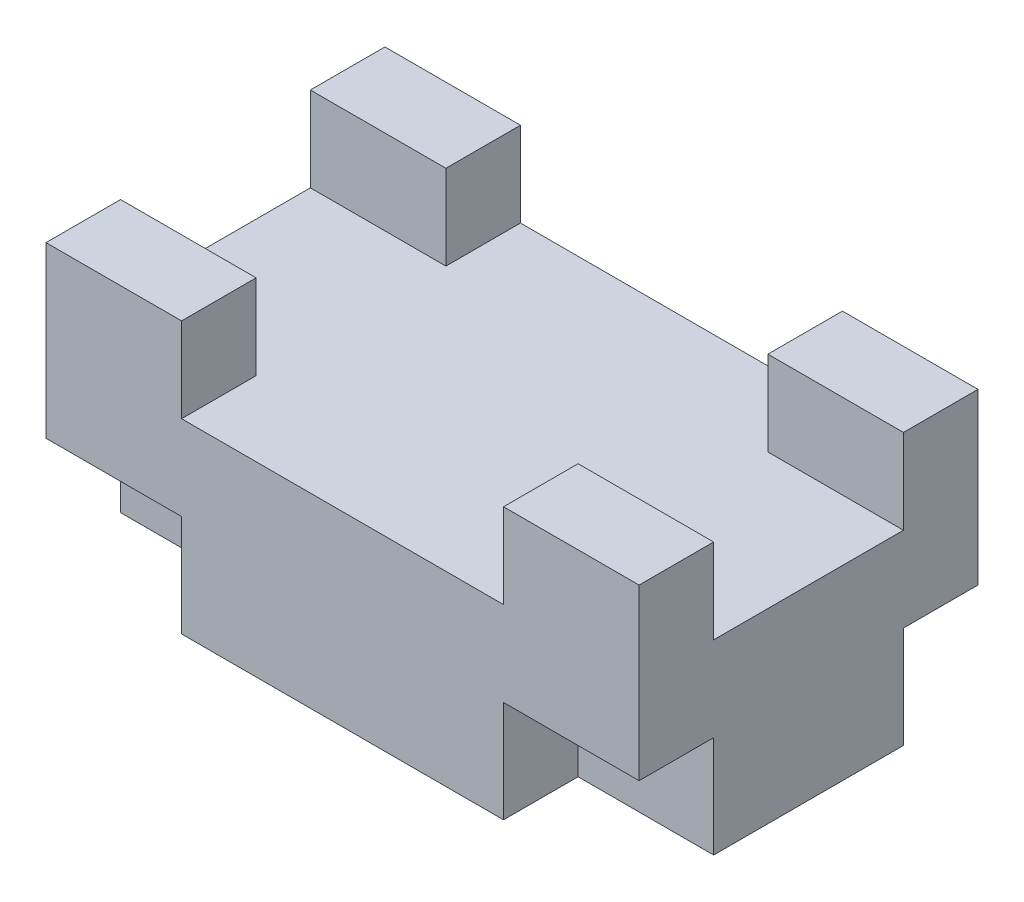
ISO-10303-21;
HEADER;
FILE_DESCRIPTION(('STEP AP214'),'2;1');
FILE_NAME('part.step','',(''),(''),'','','');
FILE_SCHEMA(('AUTOMOTIVE_DESIGN { 1 0 10303 214 1 1 1 1 }'));
ENDSEC;
DATA;
#1=APPLICATION_CONTEXT('core data for automotive mechanical design processes');
#2=APPLICATION_PROTOCOL_DEFINITION('international standard','automotive_design',2000,#1);
#3=PRODUCT_CONTEXT('',#1,'mechanical');
#4=PRODUCT('Part','Part','',(#3));
#5=PRODUCT_RELATED_PRODUCT_CATEGORY('part','',(#4));
#6=PRODUCT_DEFINITION_FORMATION('','',#4);
#7=PRODUCT_DEFINITION_CONTEXT('part definition',#1,'design');
#8=PRODUCT_DEFINITION('design','',#6,#7);
#9=PRODUCT_DEFINITION_SHAPE('','',#8);
#10=(LENGTH_UNIT() NAMED_UNIT(*) SI_UNIT(.MILLI.,.METRE.));
#11=(NAMED_UNIT(*) PLANE_ANGLE_UNIT() SI_UNIT($,.RADIAN.));
#12=(NAMED_UNIT(*) SI_UNIT($,.STERADIAN.) SOLID_ANGLE_UNIT());
#13=UNCERTAINTY_MEASURE_WITH_UNIT(LENGTH_MEASURE(1.E-05),#10,'distance_accuracy_value','');
#14=(GEOMETRIC_REPRESENTATION_CONTEXT(3) GLOBAL_UNCERTAINTY_ASSIGNED_CONTEXT((#13)) GLOBAL_UNIT_ASSIGNED_CONTEXT((#10,
#11,#12)) REPRESENTATION_CONTEXT('',''));
#15=CARTESIAN_POINT('',(0.,0.,0.));
#16=DIRECTION('',(0.,0.,1.));
#17=DIRECTION('',(1.,0.,0.));
#18=AXIS2_PLACEMENT_3D('',#15,#16,#17);
#19=CARTESIAN_POINT('',(87.5,80.,50.));
#20=DIRECTION('',(-1.,0.,0.));
#21=DIRECTION('',(0.,0.,1.));
#22=AXIS2_PLACEMENT_3D('',#19,#20,#21);
#23=PLANE('',#22);
#24=DIRECTION('',(0.,0.,-1.));
#25=VECTOR('',#24,1.);
#26=CARTESIAN_POINT('',(87.5,30.,-28.));
#27=LINE('',#26,#25);
#28=CARTESIAN_POINT('',(87.5,30.,-28.));
#29=VERTEX_POINT('',#28);
#30=CARTESIAN_POINT('',(87.5,30.,-50.));
#31=VERTEX_POINT('',#30);
#32=EDGE_CURVE('E281',#29,#31,#27,.T.);
#33=ORIENTED_EDGE('',*,*,#32,.T.);
#34=DIRECTION('',(0.,-1.,0.));
#35=VECTOR('',#34,1.);
#36=CARTESIAN_POINT('',(87.5,80.,-50.));
#37=LINE('',#36,#35);
#38=CARTESIAN_POINT('',(87.5,80.,-50.));
#39=VERTEX_POINT('',#38);
#40=EDGE_CURVE('E11',#39,#31,#37,.T.);
#41=ORIENTED_EDGE('',*,*,#40,.F.);
#42=DIRECTION('',(0.,0.,-1.));
#43=VECTOR('',#42,1.);
#44=CARTESIAN_POINT('',(87.5,80.,50.));
#45=LINE('',#44,#43);
#46=CARTESIAN_POINT('',(87.5,80.,-28.));
#47=VERTEX_POINT('',#46);
#48=EDGE_CURVE('E461',#47,#39,#45,.T.);
#49=ORIENTED_EDGE('',*,*,#48,.F.);
#50=DIRECTION('',(0.,1.,0.));
#51=VECTOR('',#50,1.);
#52=CARTESIAN_POINT('',(87.5,80.,-28.));
#53=LINE('',#52,#51);
#54=CARTESIAN_POINT('',(87.5,55.,-28.));
#55=VERTEX_POINT('',#54);
#56=EDGE_CURVE('E361',#55,#47,#53,.T.);
#57=ORIENTED_EDGE('',*,*,#56,.F.);
#58=DIRECTION('',(0.,0.,-1.));
#59=VECTOR('',#58,1.);
#60=CARTESIAN_POINT('',(87.5,55.,28.));
#61=LINE('',#60,#59);
#62=CARTESIAN_POINT('',(87.5,55.,28.));
#63=VERTEX_POINT('',#62);
#64=EDGE_CURVE('E373',#63,#55,#61,.T.);
#65=ORIENTED_EDGE('',*,*,#64,.F.);
#66=DIRECTION('',(0.,-1.,0.));
#67=VECTOR('',#66,1.);
#68=CARTESIAN_POINT('',(87.5,80.,28.));
#69=LINE('',#68,#67);
#70=CARTESIAN_POINT('',(87.5,80.,28.));
#71=VERTEX_POINT('',#70);
#72=EDGE_CURVE('E320',#71,#63,#69,.T.);
#73=ORIENTED_EDGE('',*,*,#72,.F.);
#74=CARTESIAN_POINT('',(87.5,80.,50.));
#75=VERTEX_POINT('',#74);
#76=EDGE_CURVE('E456',#75,#71,#45,.T.);
#77=ORIENTED_EDGE('',*,*,#76,.F.);
#78=DIRECTION('',(0.,-1.,0.));
#79=VECTOR('',#78,1.);
#80=CARTESIAN_POINT('',(87.5,80.,50.));
#81=LINE('',#80,#79);
#82=CARTESIAN_POINT('',(87.5,30.,50.));
#83=VERTEX_POINT('',#82);
#84=EDGE_CURVE('E476',#75,#83,#81,.T.);
#85=ORIENTED_EDGE('',*,*,#84,.T.);
#86=DIRECTION('',(0.,0.,1.));
#87=VECTOR('',#86,1.);
#88=CARTESIAN_POINT('',(87.5,30.,28.));
#89=LINE('',#88,#87);
#90=CARTESIAN_POINT('',(87.5,30.,28.));
#91=VERTEX_POINT('',#90);
#92=EDGE_CURVE('E326',#91,#83,#89,.T.);
#93=ORIENTED_EDGE('',*,*,#92,.F.);
#94=DIRECTION('',(0.,1.,0.));
#95=VECTOR('',#94,1.);
#96=CARTESIAN_POINT('',(87.5,30.,28.));
#97=LINE('',#96,#95);
#98=CARTESIAN_POINT('',(87.5,0.,28.));
#99=VERTEX_POINT('',#98);
#100=EDGE_CURVE('E340',#99,#91,#97,.T.);
#101=ORIENTED_EDGE('',*,*,#100,.F.);
#102=DIRECTION('',(0.,0.,-1.));
#103=VECTOR('',#102,1.);
#104=CARTESIAN_POINT('',(87.5,0.,50.));
#105=LINE('',#104,#103);
#106=CARTESIAN_POINT('',(87.5,0.,-28.));
#107=VERTEX_POINT('',#106);
#108=EDGE_CURVE('E440',#99,#107,#105,.T.);
#109=ORIENTED_EDGE('',*,*,#108,.T.);
#110=DIRECTION('',(0.,1.,0.));
#111=VECTOR('',#110,1.);
#112=CARTESIAN_POINT('',(87.5,30.,-28.));
#113=LINE('',#112,#111);
#114=EDGE_CURVE('E66',#107,#29,#113,.T.);
#115=ORIENTED_EDGE('',*,*,#114,.T.);
#116=EDGE_LOOP('',(#33,#41,#49,#57,#65,#73,#77,#85,#93,#101,#109,#115));
#117=FACE_BOUND('',#116,.T.);
#118=ADVANCED_FACE('F43',(#117),#23,.F.);
#119=CARTESIAN_POINT('',(-87.5,80.,-50.));
#120=DIRECTION('',(0.,0.,1.));
#121=DIRECTION('',(1.,0.,0.));
#122=AXIS2_PLACEMENT_3D('',#119,#120,#121);
#123=PLANE('',#122);
#124=DIRECTION('',(0.,1.,0.));
#125=VECTOR('',#124,1.);
#126=CARTESIAN_POINT('',(-47.5,30.,-50.));
#127=LINE('',#126,#125);
#128=CARTESIAN_POINT('',(-47.5,0.,-50.));
#129=VERTEX_POINT('',#128);
#130=CARTESIAN_POINT('',(-47.5,30.,-50.));
#131=VERTEX_POINT('',#130);
#132=EDGE_CURVE('E246',#129,#131,#127,.T.);
#133=ORIENTED_EDGE('',*,*,#132,.T.);
#134=DIRECTION('',(-1.,0.,0.));
#135=VECTOR('',#134,1.);
#136=CARTESIAN_POINT('',(-87.5,30.,-50.));
#137=LINE('',#136,#135);
#138=CARTESIAN_POINT('',(-87.5,30.,-50.));
#139=VERTEX_POINT('',#138);
#140=EDGE_CURVE('E285',#131,#139,#137,.T.);
#141=ORIENTED_EDGE('',*,*,#140,.T.);
#142=DIRECTION('',(0.,-1.,0.));
#143=VECTOR('',#142,1.);
#144=CARTESIAN_POINT('',(-87.5,80.,-50.));
#145=LINE('',#144,#143);
#146=CARTESIAN_POINT('',(-87.5,80.,-50.));
#147=VERTEX_POINT('',#146);
#148=EDGE_CURVE('E51',#147,#139,#145,.T.);
#149=ORIENTED_EDGE('',*,*,#148,.F.);
#150=DIRECTION('',(-1.,0.,0.));
#151=VECTOR('',#150,1.);
#152=CARTESIAN_POINT('',(-87.5,80.,-50.));
#153=LINE('',#152,#151);
#154=CARTESIAN_POINT('',(-47.5,80.,-50.));
#155=VERTEX_POINT('',#154);
#156=EDGE_CURVE('E460',#155,#147,#153,.T.);
#157=ORIENTED_EDGE('',*,*,#156,.F.);
#158=DIRECTION('',(0.,-1.,0.));
#159=VECTOR('',#158,1.);
#160=CARTESIAN_POINT('',(-47.5,80.,-50.));
#161=LINE('',#160,#159);
#162=CARTESIAN_POINT('',(-47.5,55.,-50.));
#163=VERTEX_POINT('',#162);
#164=EDGE_CURVE('E412',#155,#163,#161,.T.);
#165=ORIENTED_EDGE('',*,*,#164,.T.);
#166=DIRECTION('',(1.,0.,0.));
#167=VECTOR('',#166,1.);
#168=CARTESIAN_POINT('',(-47.5,55.,-50.));
#169=LINE('',#168,#167);
#170=CARTESIAN_POINT('',(47.5,55.,-50.));
#171=VERTEX_POINT('',#170);
#172=EDGE_CURVE('E416',#163,#171,#169,.T.);
#173=ORIENTED_EDGE('',*,*,#172,.T.);
#174=DIRECTION('',(0.,1.,0.));
#175=VECTOR('',#174,1.);
#176=CARTESIAN_POINT('',(47.5,80.,-50.));
#177=LINE('',#176,#175);
#178=CARTESIAN_POINT('',(47.5,80.,-50.));
#179=VERTEX_POINT('',#178);
#180=EDGE_CURVE('E421',#171,#179,#177,.T.);
#181=ORIENTED_EDGE('',*,*,#180,.T.);
#182=EDGE_CURVE('E462',#39,#179,#153,.T.);
#183=ORIENTED_EDGE('',*,*,#182,.F.);
#184=ORIENTED_EDGE('',*,*,#40,.T.);
#185=DIRECTION('',(-1.,0.,0.));
#186=VECTOR('',#185,1.);
#187=CARTESIAN_POINT('',(87.5,30.,-50.));
#188=LINE('',#187,#186);
#189=CARTESIAN_POINT('',(47.5,30.,-50.));
#190=VERTEX_POINT('',#189);
#191=EDGE_CURVE('E264',#31,#190,#188,.T.);
#192=ORIENTED_EDGE('',*,*,#191,.T.);
#193=DIRECTION('',(0.,-1.,0.));
#194=VECTOR('',#193,1.);
#195=CARTESIAN_POINT('',(47.5,30.,-50.));
#196=LINE('',#195,#194);
#197=CARTESIAN_POINT('',(47.5,0.,-50.));
#198=VERTEX_POINT('',#197);
#199=EDGE_CURVE('E274',#190,#198,#196,.T.);
#200=ORIENTED_EDGE('',*,*,#199,.T.);
#201=DIRECTION('',(-1.,0.,0.));
#202=VECTOR('',#201,1.);
#203=CARTESIAN_POINT('',(-87.5,0.,-50.));
#204=LINE('',#203,#202);
#205=EDGE_CURVE('E480',#198,#129,#204,.T.);
#206=ORIENTED_EDGE('',*,*,#205,.T.);
#207=EDGE_LOOP('',(#133,#141,#149,#157,#165,#173,#181,#183,#184,#192,#200,#206));
#208=FACE_BOUND('',#207,.T.);
#209=ADVANCED_FACE('F562',(#208),#123,.F.);
#210=CARTESIAN_POINT('',(-87.5,80.,50.));
#211=DIRECTION('',(1.,0.,0.));
#212=DIRECTION('',(0.,0.,-1.));
#213=AXIS2_PLACEMENT_3D('',#210,#211,#212);
#214=PLANE('',#213);
#215=DIRECTION('',(0.,0.,-1.));
#216=VECTOR('',#215,1.);
#217=CARTESIAN_POINT('',(-87.5,30.,-28.));
#218=LINE('',#217,#216);
#219=CARTESIAN_POINT('',(-87.5,30.,-28.));
#220=VERTEX_POINT('',#219);
#221=EDGE_CURVE('E233',#220,#139,#218,.T.);
#222=ORIENTED_EDGE('',*,*,#221,.F.);
#223=DIRECTION('',(0.,-1.,0.));
#224=VECTOR('',#223,1.);
#225=CARTESIAN_POINT('',(-87.5,30.,-28.));
#226=LINE('',#225,#224);
#227=CARTESIAN_POINT('',(-87.5,0.,-28.));
#228=VERTEX_POINT('',#227);
#229=EDGE_CURVE('E237',#220,#228,#226,.T.);
#230=ORIENTED_EDGE('',*,*,#229,.T.);
#231=DIRECTION('',(0.,0.,1.));
#232=VECTOR('',#231,1.);
#233=CARTESIAN_POINT('',(-87.5,0.,50.));
#234=LINE('',#233,#232);
#235=CARTESIAN_POINT('',(-87.5,0.,28.));
#236=VERTEX_POINT('',#235);
#237=EDGE_CURVE('E484',#228,#236,#234,.T.);
#238=ORIENTED_EDGE('',*,*,#237,.T.);
#239=DIRECTION('',(0.,-1.,0.));
#240=VECTOR('',#239,1.);
#241=CARTESIAN_POINT('',(-87.5,30.,28.));
#242=LINE('',#241,#240);
#243=CARTESIAN_POINT('',(-87.5,30.,28.));
#244=VERTEX_POINT('',#243);
#245=EDGE_CURVE('E291',#244,#236,#242,.T.);
#246=ORIENTED_EDGE('',*,*,#245,.F.);
#247=DIRECTION('',(0.,0.,1.));
#248=VECTOR('',#247,1.);
#249=CARTESIAN_POINT('',(-87.5,30.,28.));
#250=LINE('',#249,#248);
#251=CARTESIAN_POINT('',(-87.5,30.,50.));
#252=VERTEX_POINT('',#251);
#253=EDGE_CURVE('E316',#244,#252,#250,.T.);
#254=ORIENTED_EDGE('',*,*,#253,.T.);
#255=DIRECTION('',(0.,-1.,0.));
#256=VECTOR('',#255,1.);
#257=CARTESIAN_POINT('',(-87.5,80.,50.));
#258=LINE('',#257,#256);
#259=CARTESIAN_POINT('',(-87.5,80.,50.));
#260=VERTEX_POINT('',#259);
#261=EDGE_CURVE('E494',#260,#252,#258,.T.);
#262=ORIENTED_EDGE('',*,*,#261,.F.);
#263=DIRECTION('',(0.,0.,1.));
#264=VECTOR('',#263,1.);
#265=CARTESIAN_POINT('',(-87.5,80.,50.));
#266=LINE('',#265,#264);
#267=CARTESIAN_POINT('',(-87.5,80.,28.));
#268=VERTEX_POINT('',#267);
#269=EDGE_CURVE('E466',#268,#260,#266,.T.);
#270=ORIENTED_EDGE('',*,*,#269,.F.);
#271=DIRECTION('',(0.,-1.,0.));
#272=VECTOR('',#271,1.);
#273=CARTESIAN_POINT('',(-87.5,80.,28.));
#274=LINE('',#273,#272);
#275=CARTESIAN_POINT('',(-87.5,55.,28.));
#276=VERTEX_POINT('',#275);
#277=EDGE_CURVE('E356',#268,#276,#274,.T.);
#278=ORIENTED_EDGE('',*,*,#277,.T.);
#279=DIRECTION('',(0.,0.,-1.));
#280=VECTOR('',#279,1.);
#281=CARTESIAN_POINT('',(-87.5,55.,28.));
#282=LINE('',#281,#280);
#283=CARTESIAN_POINT('',(-87.5,55.,-28.));
#284=VERTEX_POINT('',#283);
#285=EDGE_CURVE('E360',#276,#284,#282,.T.);
#286=ORIENTED_EDGE('',*,*,#285,.T.);
#287=DIRECTION('',(0.,1.,0.));
#288=VECTOR('',#287,1.);
#289=CARTESIAN_POINT('',(-87.5,80.,-28.));
#290=LINE('',#289,#288);
#291=CARTESIAN_POINT('',(-87.5,80.,-28.));
#292=VERTEX_POINT('',#291);
#293=EDGE_CURVE('E365',#284,#292,#290,.T.);
#294=ORIENTED_EDGE('',*,*,#293,.T.);
#295=EDGE_CURVE('E467',#147,#292,#266,.T.);
#296=ORIENTED_EDGE('',*,*,#295,.F.);
#297=ORIENTED_EDGE('',*,*,#148,.T.);
#298=EDGE_LOOP('',(#222,#230,#238,#246,#254,#262,#270,#278,#286,#294,#296,#297));
#299=FACE_BOUND('',#298,.T.);
#300=ADVANCED_FACE('F249',(#299),#214,.F.);
#301=CARTESIAN_POINT('',(0.,0.,0.));
#302=DIRECTION('',(0.,-1.,0.));
#303=DIRECTION('',(0.,0.,-1.));
#304=AXIS2_PLACEMENT_3D('',#301,#302,#303);
#305=PLANE('',#304);
#306=DIRECTION('',(1.,0.,0.));
#307=VECTOR('',#306,1.);
#308=CARTESIAN_POINT('',(-87.5,0.,-28.));
#309=LINE('',#308,#307);
#310=CARTESIAN_POINT('',(-47.5,0.,-28.));
#311=VERTEX_POINT('',#310);
#312=EDGE_CURVE('E242',#228,#311,#309,.T.);
#313=ORIENTED_EDGE('',*,*,#312,.T.);
#314=DIRECTION('',(0.,0.,-1.));
#315=VECTOR('',#314,1.);
#316=CARTESIAN_POINT('',(-47.5,0.,-28.));
#317=LINE('',#316,#315);
#318=EDGE_CURVE('E256',#311,#129,#317,.T.);
#319=ORIENTED_EDGE('',*,*,#318,.T.);
#320=ORIENTED_EDGE('',*,*,#205,.F.);
#321=DIRECTION('',(0.,0.,-1.));
#322=VECTOR('',#321,1.);
#323=CARTESIAN_POINT('',(47.5,0.,-28.));
#324=LINE('',#323,#322);
#325=CARTESIAN_POINT('',(47.5,0.,-28.));
#326=VERTEX_POINT('',#325);
#327=EDGE_CURVE('E273',#326,#198,#324,.T.);
#328=ORIENTED_EDGE('',*,*,#327,.F.);
#329=DIRECTION('',(1.,0.,0.));
#330=VECTOR('',#329,1.);
#331=CARTESIAN_POINT('',(87.5,0.,-28.));
#332=LINE('',#331,#330);
#333=EDGE_CURVE('E263',#326,#107,#332,.T.);
#334=ORIENTED_EDGE('',*,*,#333,.T.);
#335=ORIENTED_EDGE('',*,*,#108,.F.);
#336=DIRECTION('',(1.,0.,0.));
#337=VECTOR('',#336,1.);
#338=CARTESIAN_POINT('',(87.5,0.,28.));
#339=LINE('',#338,#337);
#340=CARTESIAN_POINT('',(47.5,0.,28.));
#341=VERTEX_POINT('',#340);
#342=EDGE_CURVE('E329',#341,#99,#339,.T.);
#343=ORIENTED_EDGE('',*,*,#342,.F.);
#344=DIRECTION('',(0.,0.,1.));
#345=VECTOR('',#344,1.);
#346=CARTESIAN_POINT('',(47.5,0.,28.));
#347=LINE('',#346,#345);
#348=CARTESIAN_POINT('',(47.5,0.,50.));
#349=VERTEX_POINT('',#348);
#350=EDGE_CURVE('E333',#341,#349,#347,.T.);
#351=ORIENTED_EDGE('',*,*,#350,.T.);
#352=DIRECTION('',(1.,0.,0.));
#353=VECTOR('',#352,1.);
#354=CARTESIAN_POINT('',(-87.5,0.,50.));
#355=LINE('',#354,#353);
#356=CARTESIAN_POINT('',(-47.5,0.,50.));
#357=VERTEX_POINT('',#356);
#358=EDGE_CURVE('E487',#357,#349,#355,.T.);
#359=ORIENTED_EDGE('',*,*,#358,.F.);
#360=DIRECTION('',(0.,0.,1.));
#361=VECTOR('',#360,1.);
#362=CARTESIAN_POINT('',(-47.5,0.,28.));
#363=LINE('',#362,#361);
#364=CARTESIAN_POINT('',(-47.5,0.,28.));
#365=VERTEX_POINT('',#364);
#366=EDGE_CURVE('E308',#365,#357,#363,.T.);
#367=ORIENTED_EDGE('',*,*,#366,.F.);
#368=DIRECTION('',(1.,0.,0.));
#369=VECTOR('',#368,1.);
#370=CARTESIAN_POINT('',(-87.5,0.,28.));
#371=LINE('',#370,#369);
#372=EDGE_CURVE('E295',#236,#365,#371,.T.);
#373=ORIENTED_EDGE('',*,*,#372,.F.);
#374=ORIENTED_EDGE('',*,*,#237,.F.);
#375=EDGE_LOOP('',(#313,#319,#320,#328,#334,#335,#343,#351,#359,#367,#373,#374));
#376=FACE_BOUND('',#375,.T.);
#377=ADVANCED_FACE('F524',(#376),#305,.T.);
#378=CARTESIAN_POINT('',(0.,80.,0.));
#379=DIRECTION('',(0.,-1.,0.));
#380=DIRECTION('',(0.,0.,-1.));
#381=AXIS2_PLACEMENT_3D('',#378,#379,#380);
#382=PLANE('',#381);
#383=DIRECTION('',(0.,0.,1.));
#384=VECTOR('',#383,1.);
#385=CARTESIAN_POINT('',(-47.5,80.,-50.));
#386=LINE('',#385,#384);
#387=CARTESIAN_POINT('',(-47.5,80.,28.));
#388=VERTEX_POINT('',#387);
#389=CARTESIAN_POINT('',(-47.5,80.,50.));
#390=VERTEX_POINT('',#389);
#391=EDGE_CURVE('E441',#388,#390,#386,.T.);
#392=ORIENTED_EDGE('',*,*,#391,.F.);
#393=DIRECTION('',(1.,0.,0.));
#394=VECTOR('',#393,1.);
#395=CARTESIAN_POINT('',(-87.5,80.,28.));
#396=LINE('',#395,#394);
#397=EDGE_CURVE('E379',#268,#388,#396,.T.);
#398=ORIENTED_EDGE('',*,*,#397,.F.);
#399=ORIENTED_EDGE('',*,*,#269,.T.);
#400=DIRECTION('',(1.,0.,0.));
#401=VECTOR('',#400,1.);
#402=CARTESIAN_POINT('',(-87.5,80.,50.));
#403=LINE('',#402,#401);
#404=EDGE_CURVE('E472',#260,#390,#403,.T.);
#405=ORIENTED_EDGE('',*,*,#404,.T.);
#406=EDGE_LOOP('',(#392,#398,#399,#405));
#407=FACE_BOUND('',#406,.T.);
#408=ADVANCED_FACE('F544',(#407),#382,.F.);
#409=ORIENTED_EDGE('',*,*,#76,.T.);
#410=CARTESIAN_POINT('',(47.5,80.,28.));
#411=VERTEX_POINT('',#410);
#412=EDGE_CURVE('E383',#411,#71,#396,.T.);
#413=ORIENTED_EDGE('',*,*,#412,.F.);
#414=DIRECTION('',(0.,0.,1.));
#415=VECTOR('',#414,1.);
#416=CARTESIAN_POINT('',(47.5,80.,-50.));
#417=LINE('',#416,#415);
#418=CARTESIAN_POINT('',(47.5,80.,50.));
#419=VERTEX_POINT('',#418);
#420=EDGE_CURVE('E446',#411,#419,#417,.T.);
#421=ORIENTED_EDGE('',*,*,#420,.T.);
#422=EDGE_CURVE('E471',#419,#75,#403,.T.);
#423=ORIENTED_EDGE('',*,*,#422,.T.);
#424=EDGE_LOOP('',(#409,#413,#421,#423));
#425=FACE_BOUND('',#424,.T.);
#426=ADVANCED_FACE('F607',(#425),#382,.F.);
#427=CARTESIAN_POINT('',(-47.5,80.,-50.));
#428=DIRECTION('',(-1.,0.,0.));
#429=DIRECTION('',(0.,0.,1.));
#430=AXIS2_PLACEMENT_3D('',#427,#428,#429);
#431=PLANE('',#430);
#432=DIRECTION('',(0.,0.,1.));
#433=VECTOR('',#432,1.);
#434=CARTESIAN_POINT('',(-47.5,55.,-50.));
#435=LINE('',#434,#433);
#436=CARTESIAN_POINT('',(-47.5,55.,28.));
#437=VERTEX_POINT('',#436);
#438=CARTESIAN_POINT('',(-47.5,55.,50.));
#439=VERTEX_POINT('',#438);
#440=EDGE_CURVE('E425',#437,#439,#435,.T.);
#441=ORIENTED_EDGE('',*,*,#440,.F.);
#442=DIRECTION('',(0.,1.,0.));
#443=VECTOR('',#442,1.);
#444=CARTESIAN_POINT('',(-47.5,80.,28.));
#445=LINE('',#444,#443);
#446=EDGE_CURVE('E407',#437,#388,#445,.T.);
#447=ORIENTED_EDGE('',*,*,#446,.T.);
#448=ORIENTED_EDGE('',*,*,#391,.T.);
#449=DIRECTION('',(0.,-1.,0.));
#450=VECTOR('',#449,1.);
#451=CARTESIAN_POINT('',(-47.5,80.,50.));
#452=LINE('',#451,#450);
#453=EDGE_CURVE('E411',#390,#439,#452,.T.);
#454=ORIENTED_EDGE('',*,*,#453,.T.);
#455=EDGE_LOOP('',(#441,#447,#448,#454));
#456=FACE_BOUND('',#455,.T.);
#457=ADVANCED_FACE('F658',(#456),#431,.F.);
#458=CARTESIAN_POINT('',(47.5,80.,-50.));
#459=DIRECTION('',(1.,0.,0.));
#460=DIRECTION('',(0.,0.,-1.));
#461=AXIS2_PLACEMENT_3D('',#458,#459,#460);
#462=PLANE('',#461);
#463=ORIENTED_EDGE('',*,*,#420,.F.);
#464=DIRECTION('',(0.,-1.,0.));
#465=VECTOR('',#464,1.);
#466=CARTESIAN_POINT('',(47.5,80.,28.));
#467=LINE('',#466,#465);
#468=CARTESIAN_POINT('',(47.5,55.,28.));
#469=VERTEX_POINT('',#468);
#470=EDGE_CURVE('E403',#411,#469,#467,.T.);
#471=ORIENTED_EDGE('',*,*,#470,.T.);
#472=DIRECTION('',(0.,0.,1.));
#473=VECTOR('',#472,1.);
#474=CARTESIAN_POINT('',(47.5,55.,-50.));
#475=LINE('',#474,#473);
#476=CARTESIAN_POINT('',(47.5,55.,50.));
#477=VERTEX_POINT('',#476);
#478=EDGE_CURVE('E451',#469,#477,#475,.T.);
#479=ORIENTED_EDGE('',*,*,#478,.T.);
#480=DIRECTION('',(0.,1.,0.));
#481=VECTOR('',#480,1.);
#482=CARTESIAN_POINT('',(47.5,80.,50.));
#483=LINE('',#482,#481);
#484=EDGE_CURVE('E417',#477,#419,#483,.T.);
#485=ORIENTED_EDGE('',*,*,#484,.T.);
#486=EDGE_LOOP('',(#463,#471,#479,#485));
#487=FACE_BOUND('',#486,.T.);
#488=ADVANCED_FACE('F652',(#487),#462,.F.);
#489=ORIENTED_EDGE('',*,*,#295,.T.);
#490=DIRECTION('',(1.,0.,0.));
#491=VECTOR('',#490,1.);
#492=CARTESIAN_POINT('',(-87.5,80.,-28.));
#493=LINE('',#492,#491);
#494=CARTESIAN_POINT('',(-47.5,80.,-28.));
#495=VERTEX_POINT('',#494);
#496=EDGE_CURVE('E384',#292,#495,#493,.T.);
#497=ORIENTED_EDGE('',*,*,#496,.T.);
#498=EDGE_CURVE('E436',#155,#495,#386,.T.);
#499=ORIENTED_EDGE('',*,*,#498,.F.);
#500=ORIENTED_EDGE('',*,*,#156,.T.);
#501=EDGE_LOOP('',(#489,#497,#499,#500));
#502=FACE_BOUND('',#501,.T.);
#503=ADVANCED_FACE('F558',(#502),#382,.F.);
#504=CARTESIAN_POINT('',(-87.5,80.,50.));
#505=DIRECTION('',(0.,0.,-1.));
#506=DIRECTION('',(-1.,0.,0.));
#507=AXIS2_PLACEMENT_3D('',#504,#505,#506);
#508=PLANE('',#507);
#509=ORIENTED_EDGE('',*,*,#261,.T.);
#510=DIRECTION('',(-1.,0.,0.));
#511=VECTOR('',#510,1.);
#512=CARTESIAN_POINT('',(-87.5,30.,50.));
#513=LINE('',#512,#511);
#514=CARTESIAN_POINT('',(-47.5,30.,50.));
#515=VERTEX_POINT('',#514);
#516=EDGE_CURVE('E296',#515,#252,#513,.T.);
#517=ORIENTED_EDGE('',*,*,#516,.F.);
#518=DIRECTION('',(0.,1.,0.));
#519=VECTOR('',#518,1.);
#520=CARTESIAN_POINT('',(-47.5,30.,50.));
#521=LINE('',#520,#519);
#522=EDGE_CURVE('E309',#357,#515,#521,.T.);
#523=ORIENTED_EDGE('',*,*,#522,.F.);
#524=ORIENTED_EDGE('',*,*,#358,.T.);
#525=DIRECTION('',(0.,-1.,0.));
#526=VECTOR('',#525,1.);
#527=CARTESIAN_POINT('',(47.5,30.,50.));
#528=LINE('',#527,#526);
#529=CARTESIAN_POINT('',(47.5,30.,50.));
#530=VERTEX_POINT('',#529);
#531=EDGE_CURVE('E337',#530,#349,#528,.T.);
#532=ORIENTED_EDGE('',*,*,#531,.F.);
#533=DIRECTION('',(-1.,0.,0.));
#534=VECTOR('',#533,1.);
#535=CARTESIAN_POINT('',(87.5,30.,50.));
#536=LINE('',#535,#534);
#537=EDGE_CURVE('E313',#83,#530,#536,.T.);
#538=ORIENTED_EDGE('',*,*,#537,.F.);
#539=ORIENTED_EDGE('',*,*,#84,.F.);
#540=ORIENTED_EDGE('',*,*,#422,.F.);
#541=ORIENTED_EDGE('',*,*,#484,.F.);
#542=DIRECTION('',(1.,0.,0.));
#543=VECTOR('',#542,1.);
#544=CARTESIAN_POINT('',(-47.5,55.,50.));
#545=LINE('',#544,#543);
#546=EDGE_CURVE('E429',#439,#477,#545,.T.);
#547=ORIENTED_EDGE('',*,*,#546,.F.);
#548=ORIENTED_EDGE('',*,*,#453,.F.);
#549=ORIENTED_EDGE('',*,*,#404,.F.);
#550=EDGE_LOOP('',(#509,#517,#523,#524,#532,#538,#539,#540,#541,#547,#548,#549));
#551=FACE_BOUND('',#550,.T.);
#552=ADVANCED_FACE('F538',(#551),#508,.F.);
#553=CARTESIAN_POINT('',(47.5,80.,-28.));
#554=VERTEX_POINT('',#553);
#555=EDGE_CURVE('E442',#179,#554,#417,.T.);
#556=ORIENTED_EDGE('',*,*,#555,.T.);
#557=EDGE_CURVE('E388',#554,#47,#493,.T.);
#558=ORIENTED_EDGE('',*,*,#557,.T.);
#559=ORIENTED_EDGE('',*,*,#48,.T.);
#560=ORIENTED_EDGE('',*,*,#182,.T.);
#561=EDGE_LOOP('',(#556,#558,#559,#560));
#562=FACE_BOUND('',#561,.T.);
#563=ADVANCED_FACE('F594',(#562),#382,.F.);
#564=ORIENTED_EDGE('',*,*,#498,.T.);
#565=DIRECTION('',(0.,-1.,0.));
#566=VECTOR('',#565,1.);
#567=CARTESIAN_POINT('',(-47.5,80.,-28.));
#568=LINE('',#567,#566);
#569=CARTESIAN_POINT('',(-47.5,55.,-28.));
#570=VERTEX_POINT('',#569);
#571=EDGE_CURVE('E399',#495,#570,#568,.T.);
#572=ORIENTED_EDGE('',*,*,#571,.T.);
#573=EDGE_CURVE('E452',#163,#570,#435,.T.);
#574=ORIENTED_EDGE('',*,*,#573,.F.);
#575=ORIENTED_EDGE('',*,*,#164,.F.);
#576=EDGE_LOOP('',(#564,#572,#574,#575));
#577=FACE_BOUND('',#576,.T.);
#578=ADVANCED_FACE('F650',(#577),#431,.F.);
#579=CARTESIAN_POINT('',(47.5,55.,-28.));
#580=VERTEX_POINT('',#579);
#581=EDGE_CURVE('E447',#171,#580,#475,.T.);
#582=ORIENTED_EDGE('',*,*,#581,.T.);
#583=DIRECTION('',(0.,1.,0.));
#584=VECTOR('',#583,1.);
#585=CARTESIAN_POINT('',(47.5,80.,-28.));
#586=LINE('',#585,#584);
#587=EDGE_CURVE('E382',#580,#554,#586,.T.);
#588=ORIENTED_EDGE('',*,*,#587,.T.);
#589=ORIENTED_EDGE('',*,*,#555,.F.);
#590=ORIENTED_EDGE('',*,*,#180,.F.);
#591=EDGE_LOOP('',(#582,#588,#589,#590));
#592=FACE_BOUND('',#591,.T.);
#593=ADVANCED_FACE('F647',(#592),#462,.F.);
#594=CARTESIAN_POINT('',(-47.5,55.,-50.));
#595=DIRECTION('',(0.,-1.,0.));
#596=DIRECTION('',(0.,0.,-1.));
#597=AXIS2_PLACEMENT_3D('',#594,#595,#596);
#598=PLANE('',#597);
#599=ORIENTED_EDGE('',*,*,#573,.T.);
#600=DIRECTION('',(1.,0.,0.));
#601=VECTOR('',#600,1.);
#602=CARTESIAN_POINT('',(-87.5,55.,-28.));
#603=LINE('',#602,#601);
#604=EDGE_CURVE('E389',#284,#570,#603,.T.);
#605=ORIENTED_EDGE('',*,*,#604,.F.);
#606=ORIENTED_EDGE('',*,*,#285,.F.);
#607=DIRECTION('',(1.,0.,0.));
#608=VECTOR('',#607,1.);
#609=CARTESIAN_POINT('',(-87.5,55.,28.));
#610=LINE('',#609,#608);
#611=EDGE_CURVE('E393',#276,#437,#610,.T.);
#612=ORIENTED_EDGE('',*,*,#611,.T.);
#613=ORIENTED_EDGE('',*,*,#440,.T.);
#614=ORIENTED_EDGE('',*,*,#546,.T.);
#615=ORIENTED_EDGE('',*,*,#478,.F.);
#616=EDGE_CURVE('E369',#469,#63,#610,.T.);
#617=ORIENTED_EDGE('',*,*,#616,.T.);
#618=ORIENTED_EDGE('',*,*,#64,.T.);
#619=EDGE_CURVE('E392',#580,#55,#603,.T.);
#620=ORIENTED_EDGE('',*,*,#619,.F.);
#621=ORIENTED_EDGE('',*,*,#581,.F.);
#622=ORIENTED_EDGE('',*,*,#172,.F.);
#623=EDGE_LOOP('',(#599,#605,#606,#612,#613,#614,#615,#617,#618,#620,#621,#622));
#624=FACE_BOUND('',#623,.T.);
#625=ADVANCED_FACE('F552',(#624),#598,.F.);
#626=CARTESIAN_POINT('',(-87.5,80.,-28.));
#627=DIRECTION('',(0.,0.,-1.));
#628=DIRECTION('',(0.,1.,0.));
#629=AXIS2_PLACEMENT_3D('',#626,#627,#628);
#630=PLANE('',#629);
#631=ORIENTED_EDGE('',*,*,#619,.T.);
#632=ORIENTED_EDGE('',*,*,#56,.T.);
#633=ORIENTED_EDGE('',*,*,#557,.F.);
#634=ORIENTED_EDGE('',*,*,#587,.F.);
#635=EDGE_LOOP('',(#631,#632,#633,#634));
#636=FACE_BOUND('',#635,.T.);
#637=ADVANCED_FACE('F599',(#636),#630,.F.);
#638=CARTESIAN_POINT('',(-87.5,80.,28.));
#639=DIRECTION('',(0.,0.,1.));
#640=DIRECTION('',(0.,-1.,0.));
#641=AXIS2_PLACEMENT_3D('',#638,#639,#640);
#642=PLANE('',#641);
#643=ORIENTED_EDGE('',*,*,#412,.T.);
#644=ORIENTED_EDGE('',*,*,#72,.T.);
#645=ORIENTED_EDGE('',*,*,#616,.F.);
#646=ORIENTED_EDGE('',*,*,#470,.F.);
#647=EDGE_LOOP('',(#643,#644,#645,#646));
#648=FACE_BOUND('',#647,.T.);
#649=ADVANCED_FACE('F603',(#648),#642,.F.);
#650=ORIENTED_EDGE('',*,*,#611,.F.);
#651=ORIENTED_EDGE('',*,*,#277,.F.);
#652=ORIENTED_EDGE('',*,*,#397,.T.);
#653=ORIENTED_EDGE('',*,*,#446,.F.);
#654=EDGE_LOOP('',(#650,#651,#652,#653));
#655=FACE_BOUND('',#654,.T.);
#656=ADVANCED_FACE('F548',(#655),#642,.F.);
#657=ORIENTED_EDGE('',*,*,#496,.F.);
#658=ORIENTED_EDGE('',*,*,#293,.F.);
#659=ORIENTED_EDGE('',*,*,#604,.T.);
#660=ORIENTED_EDGE('',*,*,#571,.F.);
#661=EDGE_LOOP('',(#657,#658,#659,#660));
#662=FACE_BOUND('',#661,.T.);
#663=ADVANCED_FACE('F556',(#662),#630,.F.);
#664=CARTESIAN_POINT('',(47.5,30.,28.));
#665=DIRECTION('',(-1.,0.,0.));
#666=DIRECTION('',(0.,0.,1.));
#667=AXIS2_PLACEMENT_3D('',#664,#665,#666);
#668=PLANE('',#667);
#669=ORIENTED_EDGE('',*,*,#531,.T.);
#670=ORIENTED_EDGE('',*,*,#350,.F.);
#671=DIRECTION('',(0.,-1.,0.));
#672=VECTOR('',#671,1.);
#673=CARTESIAN_POINT('',(47.5,30.,28.));
#674=LINE('',#673,#672);
#675=CARTESIAN_POINT('',(47.5,30.,28.));
#676=VERTEX_POINT('',#675);
#677=EDGE_CURVE('E346',#676,#341,#674,.T.);
#678=ORIENTED_EDGE('',*,*,#677,.F.);
#679=DIRECTION('',(0.,0.,1.));
#680=VECTOR('',#679,1.);
#681=CARTESIAN_POINT('',(47.5,30.,28.));
#682=LINE('',#681,#680);
#683=EDGE_CURVE('E330',#676,#530,#682,.T.);
#684=ORIENTED_EDGE('',*,*,#683,.T.);
#685=EDGE_LOOP('',(#669,#670,#678,#684));
#686=FACE_BOUND('',#685,.T.);
#687=ADVANCED_FACE('F638',(#686),#668,.F.);
#688=CARTESIAN_POINT('',(87.5,30.,28.));
#689=DIRECTION('',(0.,1.,0.));
#690=DIRECTION('',(0.,0.,1.));
#691=AXIS2_PLACEMENT_3D('',#688,#689,#690);
#692=PLANE('',#691);
#693=ORIENTED_EDGE('',*,*,#537,.T.);
#694=ORIENTED_EDGE('',*,*,#683,.F.);
#695=DIRECTION('',(-1.,0.,0.));
#696=VECTOR('',#695,1.);
#697=CARTESIAN_POINT('',(87.5,30.,28.));
#698=LINE('',#697,#696);
#699=EDGE_CURVE('E349',#91,#676,#698,.T.);
#700=ORIENTED_EDGE('',*,*,#699,.F.);
#701=ORIENTED_EDGE('',*,*,#92,.T.);
#702=EDGE_LOOP('',(#693,#694,#700,#701));
#703=FACE_BOUND('',#702,.T.);
#704=ADVANCED_FACE('F617',(#703),#692,.F.);
#705=CARTESIAN_POINT('',(0.,0.,28.));
#706=DIRECTION('',(0.,0.,-1.));
#707=DIRECTION('',(-1.,0.,0.));
#708=AXIS2_PLACEMENT_3D('',#705,#706,#707);
#709=PLANE('',#708);
#710=ORIENTED_EDGE('',*,*,#100,.T.);
#711=ORIENTED_EDGE('',*,*,#699,.T.);
#712=ORIENTED_EDGE('',*,*,#677,.T.);
#713=ORIENTED_EDGE('',*,*,#342,.T.);
#714=EDGE_LOOP('',(#710,#711,#712,#713));
#715=FACE_BOUND('',#714,.T.);
#716=ADVANCED_FACE('F620',(#715),#709,.F.);
#717=CARTESIAN_POINT('',(-87.5,30.,28.));
#718=DIRECTION('',(0.,1.,0.));
#719=DIRECTION('',(0.,0.,1.));
#720=AXIS2_PLACEMENT_3D('',#717,#718,#719);
#721=PLANE('',#720);
#722=ORIENTED_EDGE('',*,*,#516,.T.);
#723=ORIENTED_EDGE('',*,*,#253,.F.);
#724=DIRECTION('',(-1.,0.,0.));
#725=VECTOR('',#724,1.);
#726=CARTESIAN_POINT('',(-87.5,30.,28.));
#727=LINE('',#726,#725);
#728=CARTESIAN_POINT('',(-47.5,30.,28.));
#729=VERTEX_POINT('',#728);
#730=EDGE_CURVE('E304',#729,#244,#727,.T.);
#731=ORIENTED_EDGE('',*,*,#730,.F.);
#732=DIRECTION('',(0.,0.,1.));
#733=VECTOR('',#732,1.);
#734=CARTESIAN_POINT('',(-47.5,30.,28.));
#735=LINE('',#734,#733);
#736=EDGE_CURVE('E321',#729,#515,#735,.T.);
#737=ORIENTED_EDGE('',*,*,#736,.T.);
#738=EDGE_LOOP('',(#722,#723,#731,#737));
#739=FACE_BOUND('',#738,.T.);
#740=ADVANCED_FACE('F532',(#739),#721,.F.);
#741=CARTESIAN_POINT('',(-47.5,30.,28.));
#742=DIRECTION('',(1.,0.,0.));
#743=DIRECTION('',(0.,0.,-1.));
#744=AXIS2_PLACEMENT_3D('',#741,#742,#743);
#745=PLANE('',#744);
#746=ORIENTED_EDGE('',*,*,#522,.T.);
#747=ORIENTED_EDGE('',*,*,#736,.F.);
#748=DIRECTION('',(0.,1.,0.));
#749=VECTOR('',#748,1.);
#750=CARTESIAN_POINT('',(-47.5,30.,28.));
#751=LINE('',#750,#749);
#752=EDGE_CURVE('E300',#365,#729,#751,.T.);
#753=ORIENTED_EDGE('',*,*,#752,.F.);
#754=ORIENTED_EDGE('',*,*,#366,.T.);
#755=EDGE_LOOP('',(#746,#747,#753,#754));
#756=FACE_BOUND('',#755,.T.);
#757=ADVANCED_FACE('F626',(#756),#745,.F.);
#758=CARTESIAN_POINT('',(0.,0.,28.));
#759=DIRECTION('',(0.,0.,1.));
#760=DIRECTION('',(1.,0.,0.));
#761=AXIS2_PLACEMENT_3D('',#758,#759,#760);
#762=PLANE('',#761);
#763=ORIENTED_EDGE('',*,*,#245,.T.);
#764=ORIENTED_EDGE('',*,*,#372,.T.);
#765=ORIENTED_EDGE('',*,*,#752,.T.);
#766=ORIENTED_EDGE('',*,*,#730,.T.);
#767=EDGE_LOOP('',(#763,#764,#765,#766));
#768=FACE_BOUND('',#767,.T.);
#769=ADVANCED_FACE('F529',(#768),#762,.T.);
#770=CARTESIAN_POINT('',(87.5,30.,-28.));
#771=DIRECTION('',(0.,-1.,0.));
#772=DIRECTION('',(0.,0.,-1.));
#773=AXIS2_PLACEMENT_3D('',#770,#771,#772);
#774=PLANE('',#773);
#775=ORIENTED_EDGE('',*,*,#191,.F.);
#776=ORIENTED_EDGE('',*,*,#32,.F.);
#777=DIRECTION('',(-1.,0.,0.));
#778=VECTOR('',#777,1.);
#779=CARTESIAN_POINT('',(87.5,30.,-28.));
#780=LINE('',#779,#778);
#781=CARTESIAN_POINT('',(47.5,30.,-28.));
#782=VERTEX_POINT('',#781);
#783=EDGE_CURVE('E270',#29,#782,#780,.T.);
#784=ORIENTED_EDGE('',*,*,#783,.T.);
#785=DIRECTION('',(0.,0.,-1.));
#786=VECTOR('',#785,1.);
#787=CARTESIAN_POINT('',(47.5,30.,-28.));
#788=LINE('',#787,#786);
#789=EDGE_CURVE('E286',#782,#190,#788,.T.);
#790=ORIENTED_EDGE('',*,*,#789,.T.);
#791=EDGE_LOOP('',(#775,#776,#784,#790));
#792=FACE_BOUND('',#791,.T.);
#793=ADVANCED_FACE('F578',(#792),#774,.T.);
#794=CARTESIAN_POINT('',(47.5,30.,-28.));
#795=DIRECTION('',(1.,0.,0.));
#796=DIRECTION('',(0.,0.,-1.));
#797=AXIS2_PLACEMENT_3D('',#794,#795,#796);
#798=PLANE('',#797);
#799=ORIENTED_EDGE('',*,*,#199,.F.);
#800=ORIENTED_EDGE('',*,*,#789,.F.);
#801=DIRECTION('',(0.,-1.,0.));
#802=VECTOR('',#801,1.);
#803=CARTESIAN_POINT('',(47.5,30.,-28.));
#804=LINE('',#803,#802);
#805=EDGE_CURVE('E267',#782,#326,#804,.T.);
#806=ORIENTED_EDGE('',*,*,#805,.T.);
#807=ORIENTED_EDGE('',*,*,#327,.T.);
#808=EDGE_LOOP('',(#799,#800,#806,#807));
#809=FACE_BOUND('',#808,.T.);
#810=ADVANCED_FACE('F567',(#809),#798,.T.);
#811=CARTESIAN_POINT('',(0.,0.,-28.));
#812=DIRECTION('',(0.,0.,1.));
#813=DIRECTION('',(-1.,0.,0.));
#814=AXIS2_PLACEMENT_3D('',#811,#812,#813);
#815=PLANE('',#814);
#816=ORIENTED_EDGE('',*,*,#114,.F.);
#817=ORIENTED_EDGE('',*,*,#333,.F.);
#818=ORIENTED_EDGE('',*,*,#805,.F.);
#819=ORIENTED_EDGE('',*,*,#783,.F.);
#820=EDGE_LOOP('',(#816,#817,#818,#819));
#821=FACE_BOUND('',#820,.T.);
#822=ADVANCED_FACE('F570',(#821),#815,.F.);
#823=CARTESIAN_POINT('',(-47.5,30.,-28.));
#824=DIRECTION('',(-1.,0.,0.));
#825=DIRECTION('',(0.,0.,1.));
#826=AXIS2_PLACEMENT_3D('',#823,#824,#825);
#827=PLANE('',#826);
#828=ORIENTED_EDGE('',*,*,#132,.F.);
#829=ORIENTED_EDGE('',*,*,#318,.F.);
#830=DIRECTION('',(0.,1.,0.));
#831=VECTOR('',#830,1.);
#832=CARTESIAN_POINT('',(-47.5,30.,-28.));
#833=LINE('',#832,#831);
#834=CARTESIAN_POINT('',(-47.5,30.,-28.));
#835=VERTEX_POINT('',#834);
#836=EDGE_CURVE('E58',#311,#835,#833,.T.);
#837=ORIENTED_EDGE('',*,*,#836,.T.);
#838=DIRECTION('',(0.,0.,-1.));
#839=VECTOR('',#838,1.);
#840=CARTESIAN_POINT('',(-47.5,30.,-28.));
#841=LINE('',#840,#839);
#842=EDGE_CURVE('E235',#835,#131,#841,.T.);
#843=ORIENTED_EDGE('',*,*,#842,.T.);
#844=EDGE_LOOP('',(#828,#829,#837,#843));
#845=FACE_BOUND('',#844,.T.);
#846=ADVANCED_FACE('F523',(#845),#827,.T.);
#847=CARTESIAN_POINT('',(-87.5,30.,-28.));
#848=DIRECTION('',(0.,-1.,0.));
#849=DIRECTION('',(0.,0.,-1.));
#850=AXIS2_PLACEMENT_3D('',#847,#848,#849);
#851=PLANE('',#850);
#852=ORIENTED_EDGE('',*,*,#140,.F.);
#853=ORIENTED_EDGE('',*,*,#842,.F.);
#854=DIRECTION('',(-1.,0.,0.));
#855=VECTOR('',#854,1.);
#856=CARTESIAN_POINT('',(-87.5,30.,-28.));
#857=LINE('',#856,#855);
#858=EDGE_CURVE('E228',#835,#220,#857,.T.);
#859=ORIENTED_EDGE('',*,*,#858,.T.);
#860=ORIENTED_EDGE('',*,*,#221,.T.);
#861=EDGE_LOOP('',(#852,#853,#859,#860));
#862=FACE_BOUND('',#861,.T.);
#863=ADVANCED_FACE('F231',(#862),#851,.T.);
#864=CARTESIAN_POINT('',(0.,0.,-28.));
#865=DIRECTION('',(0.,0.,-1.));
#866=DIRECTION('',(1.,0.,0.));
#867=AXIS2_PLACEMENT_3D('',#864,#865,#866);
#868=PLANE('',#867);
#869=ORIENTED_EDGE('',*,*,#229,.F.);
#870=ORIENTED_EDGE('',*,*,#858,.F.);
#871=ORIENTED_EDGE('',*,*,#836,.F.);
#872=ORIENTED_EDGE('',*,*,#312,.F.);
#873=EDGE_LOOP('',(#869,#870,#871,#872));
#874=FACE_BOUND('',#873,.T.);
#875=ADVANCED_FACE('F240',(#874),#868,.T.);
#876=CLOSED_SHELL('',(#118,#209,#300,#377,#408,#426,#457,#488,#503,#552,#563,#578,#593,#625,
#637,#649,#656,#663,#687,#704,#716,#740,#757,#769,#793,#810,#822,#846,#863,#875));
#877=MANIFOLD_SOLID_BREP('B2',#876);
#878=ADVANCED_BREP_SHAPE_REPRESENTATION('',(#18,#877),#14);
#879=SHAPE_DEFINITION_REPRESENTATION(#9,#878);
ENDSEC;
END-ISO-10303-21;
